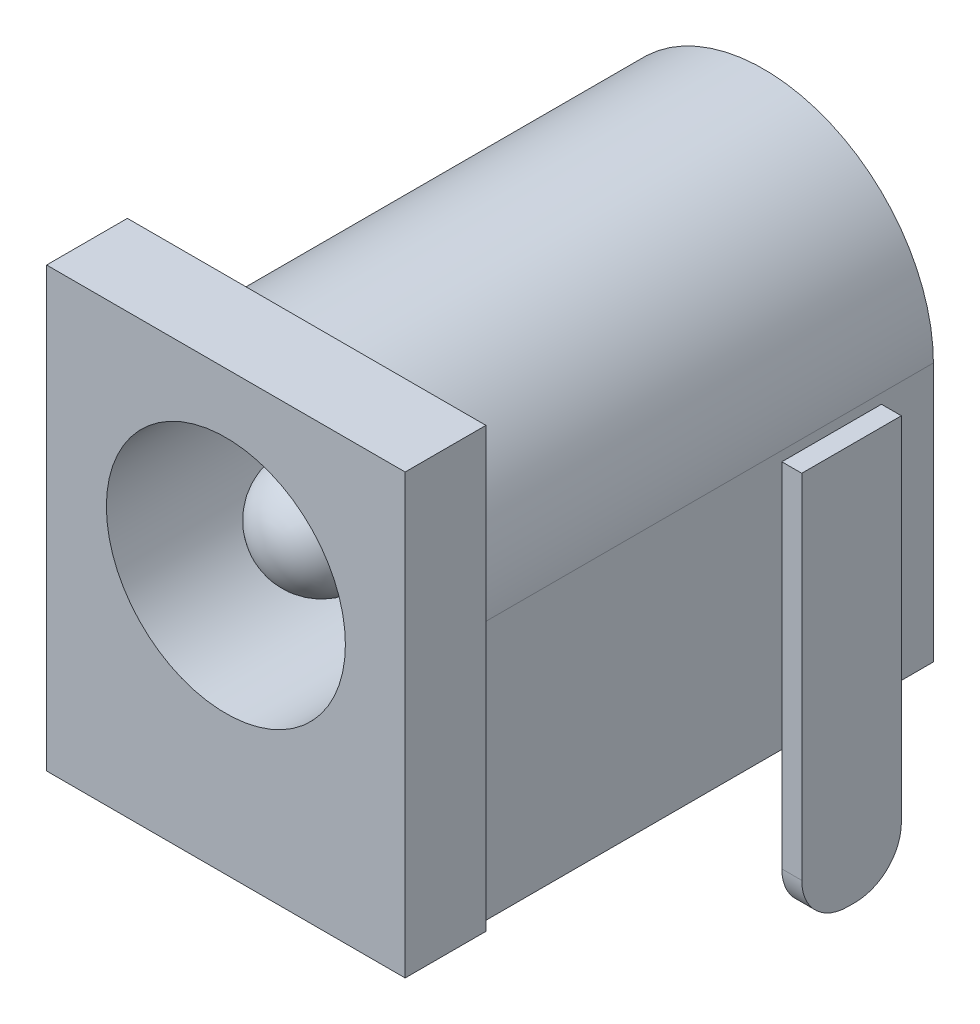
ISO-10303-21;
HEADER;
FILE_DESCRIPTION(('STEP AP214'),'2;1');
FILE_NAME('part.step','',(''),(''),'','','');
FILE_SCHEMA(('AUTOMOTIVE_DESIGN { 1 0 10303 214 1 1 1 1 }'));
ENDSEC;
DATA;
#1=APPLICATION_CONTEXT('core data for automotive mechanical design processes');
#2=APPLICATION_PROTOCOL_DEFINITION('international standard','automotive_design',2000,#1);
#3=PRODUCT_CONTEXT('',#1,'mechanical');
#4=PRODUCT('Part','Part','',(#3));
#5=PRODUCT_RELATED_PRODUCT_CATEGORY('part','',(#4));
#6=PRODUCT_DEFINITION_FORMATION('','',#4);
#7=PRODUCT_DEFINITION_CONTEXT('part definition',#1,'design');
#8=PRODUCT_DEFINITION('design','',#6,#7);
#9=PRODUCT_DEFINITION_SHAPE('','',#8);
#10=(LENGTH_UNIT() NAMED_UNIT(*) SI_UNIT(.MILLI.,.METRE.));
#11=(NAMED_UNIT(*) PLANE_ANGLE_UNIT() SI_UNIT($,.RADIAN.));
#12=(NAMED_UNIT(*) SI_UNIT($,.STERADIAN.) SOLID_ANGLE_UNIT());
#13=UNCERTAINTY_MEASURE_WITH_UNIT(LENGTH_MEASURE(1.E-05),#10,'distance_accuracy_value','');
#14=(GEOMETRIC_REPRESENTATION_CONTEXT(3) GLOBAL_UNCERTAINTY_ASSIGNED_CONTEXT((#13)) GLOBAL_UNIT_ASSIGNED_CONTEXT((#10,
#11,#12)) REPRESENTATION_CONTEXT('',''));
#15=CARTESIAN_POINT('',(0.,0.,0.));
#16=DIRECTION('',(0.,0.,1.));
#17=DIRECTION('',(1.,0.,0.));
#18=AXIS2_PLACEMENT_3D('',#15,#16,#17);
#19=CARTESIAN_POINT('',(9.00543642404111,-3.5,1.55));
#20=DIRECTION('',(0.,1.,0.));
#21=DIRECTION('',(0.,0.,1.));
#22=AXIS2_PLACEMENT_3D('',#19,#20,#21);
#23=PLANE('',#22);
#24=DIRECTION('',(1.,0.,0.));
#25=VECTOR('',#24,1.);
#26=CARTESIAN_POINT('',(-0.00100000000000794,-3.5,2.7));
#27=LINE('',#26,#25);
#28=CARTESIAN_POINT('',(9.00543642404111,-3.5,2.7));
#29=VERTEX_POINT('',#28);
#30=CARTESIAN_POINT('',(9.50543642404111,-3.5,2.7));
#31=VERTEX_POINT('',#30);
#32=EDGE_CURVE('E94',#29,#31,#27,.T.);
#33=ORIENTED_EDGE('',*,*,#32,.T.);
#34=DIRECTION('',(0.,0.,1.));
#35=VECTOR('',#34,1.);
#36=CARTESIAN_POINT('',(9.50543642404111,-3.5,4.05));
#37=LINE('',#36,#35);
#38=CARTESIAN_POINT('',(9.50543642404111,-3.5,2.9));
#39=VERTEX_POINT('',#38);
#40=EDGE_CURVE('E111',#31,#39,#37,.T.);
#41=ORIENTED_EDGE('',*,*,#40,.T.);
#42=DIRECTION('',(1.,0.,0.));
#43=VECTOR('',#42,1.);
#44=CARTESIAN_POINT('',(-0.00100000000000794,-3.5,2.9));
#45=LINE('',#44,#43);
#46=CARTESIAN_POINT('',(9.00543642404111,-3.5,2.9));
#47=VERTEX_POINT('',#46);
#48=EDGE_CURVE('E110',#47,#39,#45,.T.);
#49=ORIENTED_EDGE('',*,*,#48,.F.);
#50=DIRECTION('',(0.,0.,-1.));
#51=VECTOR('',#50,1.);
#52=CARTESIAN_POINT('',(9.00543642404111,-3.5,4.05));
#53=LINE('',#52,#51);
#54=EDGE_CURVE('E107',#47,#29,#53,.T.);
#55=ORIENTED_EDGE('',*,*,#54,.T.);
#56=EDGE_LOOP('',(#33,#41,#49,#55));
#57=FACE_BOUND('',#56,.T.);
#58=ADVANCED_FACE('F44',(#57),#23,.F.);
#59=CARTESIAN_POINT('',(9.50543642404111,-3.5,4.05));
#60=DIRECTION('',(0.,0.,-1.));
#61=DIRECTION('',(-1.,0.,0.));
#62=AXIS2_PLACEMENT_3D('',#59,#60,#61);
#63=PLANE('',#62);
#64=DIRECTION('',(1.,0.,0.));
#65=VECTOR('',#64,1.);
#66=CARTESIAN_POINT('',(-0.00100000000000395,-2.35,4.05000000000002));
#67=LINE('',#66,#65);
#68=CARTESIAN_POINT('',(9.00543642404111,-2.35,4.05));
#69=VERTEX_POINT('',#68);
#70=CARTESIAN_POINT('',(9.50543642404111,-2.35,4.05));
#71=VERTEX_POINT('',#70);
#72=EDGE_CURVE('E145',#69,#71,#67,.T.);
#73=ORIENTED_EDGE('',*,*,#72,.T.);
#74=DIRECTION('',(0.,1.,0.));
#75=VECTOR('',#74,1.);
#76=CARTESIAN_POINT('',(9.50543642404111,-3.5,4.05));
#77=LINE('',#76,#75);
#78=CARTESIAN_POINT('',(9.50543642404111,6.5,4.05));
#79=VERTEX_POINT('',#78);
#80=EDGE_CURVE('E122',#71,#79,#77,.T.);
#81=ORIENTED_EDGE('',*,*,#80,.T.);
#82=DIRECTION('',(-1.,0.,0.));
#83=VECTOR('',#82,1.);
#84=CARTESIAN_POINT('',(9.50543642404111,6.5,4.05));
#85=LINE('',#84,#83);
#86=CARTESIAN_POINT('',(9.00543642404111,6.5,4.05));
#87=VERTEX_POINT('',#86);
#88=EDGE_CURVE('E112',#79,#87,#85,.T.);
#89=ORIENTED_EDGE('',*,*,#88,.T.);
#90=DIRECTION('',(0.,1.,0.));
#91=VECTOR('',#90,1.);
#92=CARTESIAN_POINT('',(9.00543642404111,-3.5,4.05));
#93=LINE('',#92,#91);
#94=EDGE_CURVE('E114',#69,#87,#93,.T.);
#95=ORIENTED_EDGE('',*,*,#94,.F.);
#96=EDGE_LOOP('',(#73,#81,#89,#95));
#97=FACE_BOUND('',#96,.T.);
#98=ADVANCED_FACE('F153',(#97),#63,.F.);
#99=CARTESIAN_POINT('',(9.00543642404111,-3.5,4.05));
#100=DIRECTION('',(1.,0.,0.));
#101=DIRECTION('',(0.,0.,-1.));
#102=AXIS2_PLACEMENT_3D('',#99,#100,#101);
#103=PLANE('',#102);
#104=DIRECTION('',(0.,1.,0.));
#105=VECTOR('',#104,1.);
#106=CARTESIAN_POINT('',(9.00543642404111,-3.5,1.55));
#107=LINE('',#106,#105);
#108=CARTESIAN_POINT('',(9.00543642404111,-2.35,1.55));
#109=VERTEX_POINT('',#108);
#110=CARTESIAN_POINT('',(9.00543642404111,6.5,1.55));
#111=VERTEX_POINT('',#110);
#112=EDGE_CURVE('E12',#109,#111,#107,.T.);
#113=ORIENTED_EDGE('',*,*,#112,.F.);
#114=CARTESIAN_POINT('',(9.00543642404111,-2.35,2.7));
#115=DIRECTION('',(1.,0.,0.));
#116=DIRECTION('',(0.,0.,-1.));
#117=AXIS2_PLACEMENT_3D('',#114,#115,#116);
#118=CIRCLE('',#117,1.15);
#119=EDGE_CURVE('E97',#29,#109,#118,.T.);
#120=ORIENTED_EDGE('',*,*,#119,.F.);
#121=ORIENTED_EDGE('',*,*,#54,.F.);
#122=CARTESIAN_POINT('',(9.00543642404111,-2.35,2.9));
#123=DIRECTION('',(1.,0.,0.));
#124=DIRECTION('',(0.,0.,-1.));
#125=AXIS2_PLACEMENT_3D('',#122,#123,#124);
#126=CIRCLE('',#125,1.15);
#127=EDGE_CURVE('E67',#69,#47,#126,.T.);
#128=ORIENTED_EDGE('',*,*,#127,.F.);
#129=ORIENTED_EDGE('',*,*,#94,.T.);
#130=DIRECTION('',(0.,0.,-1.));
#131=VECTOR('',#130,1.);
#132=CARTESIAN_POINT('',(9.00543642404111,6.5,4.05));
#133=LINE('',#132,#131);
#134=EDGE_CURVE('E138',#87,#111,#133,.T.);
#135=ORIENTED_EDGE('',*,*,#134,.T.);
#136=EDGE_LOOP('',(#113,#120,#121,#128,#129,#135));
#137=FACE_BOUND('',#136,.T.);
#138=ADVANCED_FACE('F46',(#137),#103,.F.);
#139=CARTESIAN_POINT('',(9.50543642404111,-3.5,1.55));
#140=DIRECTION('',(0.,0.,1.));
#141=DIRECTION('',(1.,0.,0.));
#142=AXIS2_PLACEMENT_3D('',#139,#140,#141);
#143=PLANE('',#142);
#144=DIRECTION('',(0.,1.,0.));
#145=VECTOR('',#144,1.);
#146=CARTESIAN_POINT('',(9.50543642404111,-3.5,1.55));
#147=LINE('',#146,#145);
#148=CARTESIAN_POINT('',(9.50543642404111,-2.35,1.55));
#149=VERTEX_POINT('',#148);
#150=CARTESIAN_POINT('',(9.50543642404111,6.5,1.55));
#151=VERTEX_POINT('',#150);
#152=EDGE_CURVE('E52',#149,#151,#147,.T.);
#153=ORIENTED_EDGE('',*,*,#152,.F.);
#154=DIRECTION('',(1.,0.,0.));
#155=VECTOR('',#154,1.);
#156=CARTESIAN_POINT('',(-0.00100000000000894,-2.35,1.55000000000001));
#157=LINE('',#156,#155);
#158=EDGE_CURVE('E102',#109,#149,#157,.T.);
#159=ORIENTED_EDGE('',*,*,#158,.F.);
#160=ORIENTED_EDGE('',*,*,#112,.T.);
#161=DIRECTION('',(1.,0.,0.));
#162=VECTOR('',#161,1.);
#163=CARTESIAN_POINT('',(9.50543642404111,6.5,1.55));
#164=LINE('',#163,#162);
#165=EDGE_CURVE('E136',#111,#151,#164,.T.);
#166=ORIENTED_EDGE('',*,*,#165,.T.);
#167=EDGE_LOOP('',(#153,#159,#160,#166));
#168=FACE_BOUND('',#167,.T.);
#169=ADVANCED_FACE('F137',(#168),#143,.F.);
#170=CARTESIAN_POINT('',(9.50543642404111,-3.5,4.05));
#171=DIRECTION('',(-1.,0.,0.));
#172=DIRECTION('',(0.,0.,1.));
#173=AXIS2_PLACEMENT_3D('',#170,#171,#172);
#174=PLANE('',#173);
#175=ORIENTED_EDGE('',*,*,#40,.F.);
#176=CARTESIAN_POINT('',(9.50543642404111,-2.35,2.7));
#177=DIRECTION('',(-1.,0.,0.));
#178=DIRECTION('',(0.,0.,-1.));
#179=AXIS2_PLACEMENT_3D('',#176,#177,#178);
#180=CIRCLE('',#179,1.15);
#181=EDGE_CURVE('E59',#149,#31,#180,.T.);
#182=ORIENTED_EDGE('',*,*,#181,.F.);
#183=ORIENTED_EDGE('',*,*,#152,.T.);
#184=DIRECTION('',(0.,0.,1.));
#185=VECTOR('',#184,1.);
#186=CARTESIAN_POINT('',(9.50543642404111,6.5,4.05));
#187=LINE('',#186,#185);
#188=EDGE_CURVE('E117',#151,#79,#187,.T.);
#189=ORIENTED_EDGE('',*,*,#188,.T.);
#190=ORIENTED_EDGE('',*,*,#80,.F.);
#191=CARTESIAN_POINT('',(9.50543642404111,-2.35,2.9));
#192=DIRECTION('',(-1.,0.,0.));
#193=DIRECTION('',(0.,0.,-1.));
#194=AXIS2_PLACEMENT_3D('',#191,#192,#193);
#195=CIRCLE('',#194,1.15);
#196=EDGE_CURVE('E140',#39,#71,#195,.T.);
#197=ORIENTED_EDGE('',*,*,#196,.F.);
#198=EDGE_LOOP('',(#175,#182,#183,#189,#190,#197));
#199=FACE_BOUND('',#198,.T.);
#200=ADVANCED_FACE('F127',(#199),#174,.F.);
#201=CARTESIAN_POINT('',(9.00543642404111,6.5,1.55));
#202=DIRECTION('',(0.,1.,0.));
#203=DIRECTION('',(0.,0.,1.));
#204=AXIS2_PLACEMENT_3D('',#201,#202,#203);
#205=PLANE('',#204);
#206=ORIENTED_EDGE('',*,*,#134,.F.);
#207=ORIENTED_EDGE('',*,*,#88,.F.);
#208=ORIENTED_EDGE('',*,*,#188,.F.);
#209=ORIENTED_EDGE('',*,*,#165,.F.);
#210=EDGE_LOOP('',(#206,#207,#208,#209));
#211=FACE_BOUND('',#210,.T.);
#212=ADVANCED_FACE('F135',(#211),#205,.T.);
#213=CARTESIAN_POINT('',(-0.00100000000000794,-2.35,2.9));
#214=DIRECTION('',(1.,0.,0.));
#215=DIRECTION('',(0.,0.,-1.));
#216=AXIS2_PLACEMENT_3D('',#213,#214,#215);
#217=CYLINDRICAL_SURFACE('',#216,1.15);
#218=ORIENTED_EDGE('',*,*,#127,.T.);
#219=ORIENTED_EDGE('',*,*,#48,.T.);
#220=ORIENTED_EDGE('',*,*,#196,.T.);
#221=ORIENTED_EDGE('',*,*,#72,.F.);
#222=EDGE_LOOP('',(#218,#219,#220,#221));
#223=FACE_BOUND('',#222,.T.);
#224=ADVANCED_FACE('F151',(#223),#217,.T.);
#225=CARTESIAN_POINT('',(-0.00100000000000794,-2.35,2.7));
#226=DIRECTION('',(1.,0.,0.));
#227=DIRECTION('',(0.,0.,-1.));
#228=AXIS2_PLACEMENT_3D('',#225,#226,#227);
#229=CYLINDRICAL_SURFACE('',#228,1.15);
#230=ORIENTED_EDGE('',*,*,#119,.T.);
#231=ORIENTED_EDGE('',*,*,#158,.T.);
#232=ORIENTED_EDGE('',*,*,#181,.T.);
#233=ORIENTED_EDGE('',*,*,#32,.F.);
#234=EDGE_LOOP('',(#230,#231,#232,#233));
#235=FACE_BOUND('',#234,.T.);
#236=ADVANCED_FACE('F96',(#235),#229,.T.);
#237=CLOSED_SHELL('',(#58,#98,#138,#169,#200,#212,#224,#236));
#238=MANIFOLD_SOLID_BREP('B2',#237);
#239=CARTESIAN_POINT('',(4.5,6.5,3.));
#240=DIRECTION('',(0.,0.,1.));
#241=DIRECTION('',(1.,0.,0.));
#242=AXIS2_PLACEMENT_3D('',#239,#240,#241);
#243=PLANE('',#242);
#244=CARTESIAN_POINT('',(4.5,6.5,3.));
#245=DIRECTION('',(0.,0.,1.));
#246=DIRECTION('',(1.,0.,0.));
#247=AXIS2_PLACEMENT_3D('',#244,#245,#246);
#248=CIRCLE('',#247,3.);
#249=CARTESIAN_POINT('',(7.5,6.5,3.));
#250=VERTEX_POINT('',#249);
#251=EDGE_CURVE('E378',#250,#250,#248,.T.);
#252=ORIENTED_EDGE('',*,*,#251,.T.);
#253=EDGE_LOOP('',(#252));
#254=FACE_BOUND('',#253,.T.);
#255=CARTESIAN_POINT('',(4.5,6.5,3.));
#256=DIRECTION('',(0.,0.,1.));
#257=DIRECTION('',(1.,0.,0.));
#258=AXIS2_PLACEMENT_3D('',#255,#256,#257);
#259=CIRCLE('',#258,1.3411747981982);
#260=CARTESIAN_POINT('',(5.84117479819819,6.5,3.));
#261=VERTEX_POINT('',#260);
#262=EDGE_CURVE('E552',#261,#261,#259,.T.);
#263=ORIENTED_EDGE('',*,*,#262,.F.);
#264=EDGE_LOOP('',(#263));
#265=FACE_BOUND('',#264,.T.);
#266=ADVANCED_FACE('F219',(#254,#265),#243,.T.);
#267=CARTESIAN_POINT('',(5.75,-3.5,5.55));
#268=DIRECTION('',(0.,1.,0.));
#269=DIRECTION('',(0.,0.,1.));
#270=AXIS2_PLACEMENT_3D('',#267,#268,#269);
#271=PLANE('',#270);
#272=DIRECTION('',(1.,0.,0.));
#273=VECTOR('',#272,1.);
#274=CARTESIAN_POINT('',(5.75,-3.5,5.55));
#275=LINE('',#274,#273);
#276=CARTESIAN_POINT('',(4.4,-3.5,5.55));
#277=VERTEX_POINT('',#276);
#278=CARTESIAN_POINT('',(4.6,-3.5,5.55));
#279=VERTEX_POINT('',#278);
#280=EDGE_CURVE('E412',#277,#279,#275,.T.);
#281=ORIENTED_EDGE('',*,*,#280,.T.);
#282=DIRECTION('',(0.,0.,-1.));
#283=VECTOR('',#282,1.);
#284=CARTESIAN_POINT('',(4.6,-3.5,11.9209561867341));
#285=LINE('',#284,#283);
#286=CARTESIAN_POINT('',(4.6,-3.5,6.05));
#287=VERTEX_POINT('',#286);
#288=EDGE_CURVE('E541',#287,#279,#285,.T.);
#289=ORIENTED_EDGE('',*,*,#288,.F.);
#290=DIRECTION('',(-1.,0.,0.));
#291=VECTOR('',#290,1.);
#292=CARTESIAN_POINT('',(5.75,-3.5,6.05));
#293=LINE('',#292,#291);
#294=CARTESIAN_POINT('',(4.4,-3.5,6.05));
#295=VERTEX_POINT('',#294);
#296=EDGE_CURVE('E409',#287,#295,#293,.T.);
#297=ORIENTED_EDGE('',*,*,#296,.T.);
#298=DIRECTION('',(0.,0.,-1.));
#299=VECTOR('',#298,1.);
#300=CARTESIAN_POINT('',(4.4,-3.5,11.9209561867341));
#301=LINE('',#300,#299);
#302=EDGE_CURVE('E539',#295,#277,#301,.T.);
#303=ORIENTED_EDGE('',*,*,#302,.T.);
#304=EDGE_LOOP('',(#281,#289,#297,#303));
#305=FACE_BOUND('',#304,.T.);
#306=ADVANCED_FACE('F573',(#305),#271,.F.);
#307=CARTESIAN_POINT('',(5.75,-3.5,0.173550286922379));
#308=DIRECTION('',(0.,-1.,0.));
#309=DIRECTION('',(0.,0.,-1.));
#310=AXIS2_PLACEMENT_3D('',#307,#308,#309);
#311=PLANE('',#310);
#312=DIRECTION('',(1.,0.,0.));
#313=VECTOR('',#312,1.);
#314=CARTESIAN_POINT('',(5.75,-3.5,-0.326449713077622));
#315=LINE('',#314,#313);
#316=CARTESIAN_POINT('',(4.4,-3.5,-0.326449713077622));
#317=VERTEX_POINT('',#316);
#318=CARTESIAN_POINT('',(4.6,-3.5,-0.326449713077622));
#319=VERTEX_POINT('',#318);
#320=EDGE_CURVE('E395',#317,#319,#315,.T.);
#321=ORIENTED_EDGE('',*,*,#320,.T.);
#322=DIRECTION('',(0.,0.,-1.));
#323=VECTOR('',#322,1.);
#324=CARTESIAN_POINT('',(4.6,-3.5,11.9209561867341));
#325=LINE('',#324,#323);
#326=CARTESIAN_POINT('',(4.6,-3.5,0.173550286922379));
#327=VERTEX_POINT('',#326);
#328=EDGE_CURVE('E42',#319,#327,#325,.F.);
#329=ORIENTED_EDGE('',*,*,#328,.T.);
#330=DIRECTION('',(-1.,0.,0.));
#331=VECTOR('',#330,1.);
#332=CARTESIAN_POINT('',(5.75,-3.5,0.173550286922379));
#333=LINE('',#332,#331);
#334=CARTESIAN_POINT('',(4.4,-3.5,0.173550286922378));
#335=VERTEX_POINT('',#334);
#336=EDGE_CURVE('E399',#327,#335,#333,.T.);
#337=ORIENTED_EDGE('',*,*,#336,.T.);
#338=DIRECTION('',(0.,0.,-1.));
#339=VECTOR('',#338,1.);
#340=CARTESIAN_POINT('',(4.4,-3.5,11.9209561867341));
#341=LINE('',#340,#339);
#342=EDGE_CURVE('E228',#317,#335,#341,.F.);
#343=ORIENTED_EDGE('',*,*,#342,.F.);
#344=EDGE_LOOP('',(#321,#329,#337,#343));
#345=FACE_BOUND('',#344,.T.);
#346=ADVANCED_FACE('F521',(#345),#311,.T.);
#347=CARTESIAN_POINT('',(0.,0.,13.5));
#348=DIRECTION('',(0.,1.,0.));
#349=DIRECTION('',(0.,0.,1.));
#350=AXIS2_PLACEMENT_3D('',#347,#348,#349);
#351=PLANE('',#350);
#352=DIRECTION('',(0.,0.,1.));
#353=VECTOR('',#352,1.);
#354=CARTESIAN_POINT('',(5.75000000000001,0.,13.5));
#355=LINE('',#354,#353);
#356=CARTESIAN_POINT('',(5.75,0.,5.55));
#357=VERTEX_POINT('',#356);
#358=CARTESIAN_POINT('',(5.75,0.,6.05));
#359=VERTEX_POINT('',#358);
#360=EDGE_CURVE('E492',#357,#359,#355,.T.);
#361=ORIENTED_EDGE('',*,*,#360,.F.);
#362=DIRECTION('',(1.,0.,0.));
#363=VECTOR('',#362,1.);
#364=CARTESIAN_POINT('',(0.,0.,5.55));
#365=LINE('',#364,#363);
#366=CARTESIAN_POINT('',(3.25,0.,5.55));
#367=VERTEX_POINT('',#366);
#368=EDGE_CURVE('E483',#367,#357,#365,.T.);
#369=ORIENTED_EDGE('',*,*,#368,.F.);
#370=DIRECTION('',(0.,0.,-1.));
#371=VECTOR('',#370,1.);
#372=CARTESIAN_POINT('',(3.25,0.,13.5));
#373=LINE('',#372,#371);
#374=CARTESIAN_POINT('',(3.25,0.,6.05));
#375=VERTEX_POINT('',#374);
#376=EDGE_CURVE('E486',#375,#367,#373,.T.);
#377=ORIENTED_EDGE('',*,*,#376,.F.);
#378=DIRECTION('',(-1.,0.,0.));
#379=VECTOR('',#378,1.);
#380=CARTESIAN_POINT('',(0.,0.,6.05));
#381=LINE('',#380,#379);
#382=EDGE_CURVE('E489',#359,#375,#381,.T.);
#383=ORIENTED_EDGE('',*,*,#382,.F.);
#384=EDGE_LOOP('',(#361,#369,#377,#383));
#385=FACE_BOUND('',#384,.T.);
#386=DIRECTION('',(0.,0.,1.));
#387=VECTOR('',#386,1.);
#388=CARTESIAN_POINT('',(5.75000000000005,0.,13.5));
#389=LINE('',#388,#387);
#390=CARTESIAN_POINT('',(5.75,0.,0.));
#391=VERTEX_POINT('',#390);
#392=CARTESIAN_POINT('',(5.75,0.,0.173550286922379));
#393=VERTEX_POINT('',#392);
#394=EDGE_CURVE('E407',#391,#393,#389,.T.);
#395=ORIENTED_EDGE('',*,*,#394,.F.);
#396=DIRECTION('',(1.,0.,0.));
#397=VECTOR('',#396,1.);
#398=CARTESIAN_POINT('',(0.,0.,0.));
#399=LINE('',#398,#397);
#400=CARTESIAN_POINT('',(8.75986173325593,0.,0.));
#401=VERTEX_POINT('',#400);
#402=EDGE_CURVE('E456',#391,#401,#399,.T.);
#403=ORIENTED_EDGE('',*,*,#402,.T.);
#404=DIRECTION('',(0.,0.,-1.));
#405=VECTOR('',#404,1.);
#406=CARTESIAN_POINT('',(8.75986173325593,0.,11.4721847336654));
#407=LINE('',#406,#405);
#408=CARTESIAN_POINT('',(8.75986173325593,0.,11.4721847336654));
#409=VERTEX_POINT('',#408);
#410=EDGE_CURVE('E436',#409,#401,#407,.T.);
#411=ORIENTED_EDGE('',*,*,#410,.F.);
#412=DIRECTION('',(1.,0.,0.));
#413=VECTOR('',#412,1.);
#414=CARTESIAN_POINT('',(-8.20117940251179,0.,11.4721847336654));
#415=LINE('',#414,#413);
#416=CARTESIAN_POINT('',(9.,0.,11.4721847336654));
#417=VERTEX_POINT('',#416);
#418=EDGE_CURVE('E427',#409,#417,#415,.T.);
#419=ORIENTED_EDGE('',*,*,#418,.T.);
#420=DIRECTION('',(0.,0.,-1.));
#421=VECTOR('',#420,1.);
#422=CARTESIAN_POINT('',(9.,0.,13.5));
#423=LINE('',#422,#421);
#424=CARTESIAN_POINT('',(9.,0.,13.5));
#425=VERTEX_POINT('',#424);
#426=EDGE_CURVE('E475',#425,#417,#423,.T.);
#427=ORIENTED_EDGE('',*,*,#426,.F.);
#428=DIRECTION('',(1.,0.,0.));
#429=VECTOR('',#428,1.);
#430=CARTESIAN_POINT('',(0.,0.,13.5));
#431=LINE('',#430,#429);
#432=CARTESIAN_POINT('',(0.,0.,13.5));
#433=VERTEX_POINT('',#432);
#434=EDGE_CURVE('E460',#433,#425,#431,.T.);
#435=ORIENTED_EDGE('',*,*,#434,.F.);
#436=DIRECTION('',(0.,0.,-1.));
#437=VECTOR('',#436,1.);
#438=CARTESIAN_POINT('',(0.,0.,13.5));
#439=LINE('',#438,#437);
#440=CARTESIAN_POINT('',(0.,0.,11.4721847336654));
#441=VERTEX_POINT('',#440);
#442=EDGE_CURVE('E478',#433,#441,#439,.T.);
#443=ORIENTED_EDGE('',*,*,#442,.T.);
#444=CARTESIAN_POINT('',(0.240138266744069,0.,11.4721847336654));
#445=VERTEX_POINT('',#444);
#446=EDGE_CURVE('E424',#441,#445,#415,.T.);
#447=ORIENTED_EDGE('',*,*,#446,.T.);
#448=DIRECTION('',(0.,0.,-1.));
#449=VECTOR('',#448,1.);
#450=CARTESIAN_POINT('',(0.240138266744069,0.,11.4721847336654));
#451=LINE('',#450,#449);
#452=CARTESIAN_POINT('',(0.240138266744069,0.,0.));
#453=VERTEX_POINT('',#452);
#454=EDGE_CURVE('E443',#445,#453,#451,.T.);
#455=ORIENTED_EDGE('',*,*,#454,.T.);
#456=CARTESIAN_POINT('',(3.25,0.,0.));
#457=VERTEX_POINT('',#456);
#458=EDGE_CURVE('E461',#453,#457,#399,.T.);
#459=ORIENTED_EDGE('',*,*,#458,.T.);
#460=DIRECTION('',(0.,0.,-1.));
#461=VECTOR('',#460,1.);
#462=CARTESIAN_POINT('',(3.25,0.,13.5));
#463=LINE('',#462,#461);
#464=CARTESIAN_POINT('',(3.25,0.,0.173550286922379));
#465=VERTEX_POINT('',#464);
#466=EDGE_CURVE('E405',#465,#457,#463,.T.);
#467=ORIENTED_EDGE('',*,*,#466,.F.);
#468=DIRECTION('',(-1.,0.,0.));
#469=VECTOR('',#468,1.);
#470=CARTESIAN_POINT('',(0.,0.,0.173550286922378));
#471=LINE('',#470,#469);
#472=EDGE_CURVE('E504',#393,#465,#471,.T.);
#473=ORIENTED_EDGE('',*,*,#472,.F.);
#474=EDGE_LOOP('',(#395,#403,#411,#419,#427,#435,#443,#447,#455,#459,#467,#473));
#475=FACE_BOUND('',#474,.T.);
#476=ADVANCED_FACE('F593',(#385,#475),#351,.F.);
#477=CARTESIAN_POINT('',(0.,11.,0.));
#478=DIRECTION('',(0.,0.,-1.));
#479=DIRECTION('',(-1.,0.,0.));
#480=AXIS2_PLACEMENT_3D('',#477,#478,#479);
#481=PLANE('',#480);
#482=ORIENTED_EDGE('',*,*,#402,.F.);
#483=DIRECTION('',(0.,1.,0.));
#484=VECTOR('',#483,1.);
#485=CARTESIAN_POINT('',(5.75,11.,0.));
#486=LINE('',#485,#484);
#487=CARTESIAN_POINT('',(5.75,6.5,0.));
#488=VERTEX_POINT('',#487);
#489=EDGE_CURVE('E501',#391,#488,#486,.T.);
#490=ORIENTED_EDGE('',*,*,#489,.T.);
#491=DIRECTION('',(-1.,0.,0.));
#492=VECTOR('',#491,1.);
#493=CARTESIAN_POINT('',(0.,6.5,0.));
#494=LINE('',#493,#492);
#495=CARTESIAN_POINT('',(3.25,6.5,0.));
#496=VERTEX_POINT('',#495);
#497=EDGE_CURVE('E495',#488,#496,#494,.T.);
#498=ORIENTED_EDGE('',*,*,#497,.T.);
#499=DIRECTION('',(0.,-1.,0.));
#500=VECTOR('',#499,1.);
#501=CARTESIAN_POINT('',(3.25,11.,0.));
#502=LINE('',#501,#500);
#503=EDGE_CURVE('E498',#496,#457,#502,.T.);
#504=ORIENTED_EDGE('',*,*,#503,.T.);
#505=ORIENTED_EDGE('',*,*,#458,.F.);
#506=DIRECTION('',(0.,-1.,0.));
#507=VECTOR('',#506,1.);
#508=CARTESIAN_POINT('',(0.240138266744069,5.64313399778519,0.));
#509=LINE('',#508,#507);
#510=CARTESIAN_POINT('',(0.240138266744068,6.5,0.));
#511=VERTEX_POINT('',#510);
#512=EDGE_CURVE('E428',#511,#453,#509,.T.);
#513=ORIENTED_EDGE('',*,*,#512,.F.);
#514=CARTESIAN_POINT('',(4.5,6.5,0.));
#515=DIRECTION('',(0.,0.,-1.));
#516=DIRECTION('',(-1.,0.,0.));
#517=AXIS2_PLACEMENT_3D('',#514,#515,#516);
#518=CIRCLE('',#517,4.25986173325593);
#519=CARTESIAN_POINT('',(8.75986173325593,6.5,0.));
#520=VERTEX_POINT('',#519);
#521=EDGE_CURVE('E439',#511,#520,#518,.T.);
#522=ORIENTED_EDGE('',*,*,#521,.T.);
#523=DIRECTION('',(0.,-1.,0.));
#524=VECTOR('',#523,1.);
#525=CARTESIAN_POINT('',(8.75986173325593,5.64313399778519,0.));
#526=LINE('',#525,#524);
#527=EDGE_CURVE('E423',#520,#401,#526,.T.);
#528=ORIENTED_EDGE('',*,*,#527,.T.);
#529=EDGE_LOOP('',(#482,#490,#498,#504,#505,#513,#522,#528));
#530=FACE_BOUND('',#529,.T.);
#531=ADVANCED_FACE('F641',(#530),#481,.T.);
#532=CARTESIAN_POINT('',(0.,0.,13.5));
#533=DIRECTION('',(1.,0.,0.));
#534=DIRECTION('',(0.,1.,0.));
#535=AXIS2_PLACEMENT_3D('',#532,#533,#534);
#536=PLANE('',#535);
#537=DIRECTION('',(0.,1.,0.));
#538=VECTOR('',#537,1.);
#539=CARTESIAN_POINT('',(0.,0.,11.4721847336654));
#540=LINE('',#539,#538);
#541=CARTESIAN_POINT('',(0.,11.,11.4721847336654));
#542=VERTEX_POINT('',#541);
#543=EDGE_CURVE('E454',#441,#542,#540,.T.);
#544=ORIENTED_EDGE('',*,*,#543,.F.);
#545=ORIENTED_EDGE('',*,*,#442,.F.);
#546=DIRECTION('',(0.,-1.,0.));
#547=VECTOR('',#546,1.);
#548=CARTESIAN_POINT('',(0.,0.,13.5));
#549=LINE('',#548,#547);
#550=CARTESIAN_POINT('',(0.,11.,13.5));
#551=VERTEX_POINT('',#550);
#552=EDGE_CURVE('E457',#551,#433,#549,.T.);
#553=ORIENTED_EDGE('',*,*,#552,.F.);
#554=DIRECTION('',(0.,0.,-1.));
#555=VECTOR('',#554,1.);
#556=CARTESIAN_POINT('',(0.,11.,13.5));
#557=LINE('',#556,#555);
#558=EDGE_CURVE('E467',#551,#542,#557,.T.);
#559=ORIENTED_EDGE('',*,*,#558,.T.);
#560=EDGE_LOOP('',(#544,#545,#553,#559));
#561=FACE_BOUND('',#560,.T.);
#562=ADVANCED_FACE('F644',(#561),#536,.F.);
#563=CARTESIAN_POINT('',(9.,0.,13.5));
#564=DIRECTION('',(-1.,0.,0.));
#565=DIRECTION('',(0.,-1.,0.));
#566=AXIS2_PLACEMENT_3D('',#563,#564,#565);
#567=PLANE('',#566);
#568=DIRECTION('',(0.,-1.,0.));
#569=VECTOR('',#568,1.);
#570=CARTESIAN_POINT('',(9.,0.,11.4721847336654));
#571=LINE('',#570,#569);
#572=CARTESIAN_POINT('',(9.,11.,11.4721847336654));
#573=VERTEX_POINT('',#572);
#574=EDGE_CURVE('E446',#573,#417,#571,.T.);
#575=ORIENTED_EDGE('',*,*,#574,.F.);
#576=DIRECTION('',(0.,0.,-1.));
#577=VECTOR('',#576,1.);
#578=CARTESIAN_POINT('',(9.,11.,13.5));
#579=LINE('',#578,#577);
#580=CARTESIAN_POINT('',(9.,11.,13.5));
#581=VERTEX_POINT('',#580);
#582=EDGE_CURVE('E472',#581,#573,#579,.T.);
#583=ORIENTED_EDGE('',*,*,#582,.F.);
#584=DIRECTION('',(0.,1.,0.));
#585=VECTOR('',#584,1.);
#586=CARTESIAN_POINT('',(9.,0.,13.5));
#587=LINE('',#586,#585);
#588=EDGE_CURVE('E463',#425,#581,#587,.T.);
#589=ORIENTED_EDGE('',*,*,#588,.F.);
#590=ORIENTED_EDGE('',*,*,#426,.T.);
#591=EDGE_LOOP('',(#575,#583,#589,#590));
#592=FACE_BOUND('',#591,.T.);
#593=ADVANCED_FACE('F648',(#592),#567,.F.);
#594=CARTESIAN_POINT('',(0.,11.,13.5));
#595=DIRECTION('',(0.,-1.,0.));
#596=DIRECTION('',(0.,0.,-1.));
#597=AXIS2_PLACEMENT_3D('',#594,#595,#596);
#598=PLANE('',#597);
#599=DIRECTION('',(1.,0.,0.));
#600=VECTOR('',#599,1.);
#601=CARTESIAN_POINT('',(0.,11.,11.4721847336654));
#602=LINE('',#601,#600);
#603=EDGE_CURVE('E481',#542,#573,#602,.T.);
#604=ORIENTED_EDGE('',*,*,#603,.F.);
#605=ORIENTED_EDGE('',*,*,#558,.F.);
#606=DIRECTION('',(-1.,0.,0.));
#607=VECTOR('',#606,1.);
#608=CARTESIAN_POINT('',(0.,11.,13.5));
#609=LINE('',#608,#607);
#610=EDGE_CURVE('E465',#581,#551,#609,.T.);
#611=ORIENTED_EDGE('',*,*,#610,.F.);
#612=ORIENTED_EDGE('',*,*,#582,.T.);
#613=EDGE_LOOP('',(#604,#605,#611,#612));
#614=FACE_BOUND('',#613,.T.);
#615=ADVANCED_FACE('F639',(#614),#598,.F.);
#616=CARTESIAN_POINT('',(0.,11.,13.5));
#617=DIRECTION('',(0.,0.,-1.));
#618=DIRECTION('',(-1.,0.,0.));
#619=AXIS2_PLACEMENT_3D('',#616,#617,#618);
#620=PLANE('',#619);
#621=CARTESIAN_POINT('',(4.5,6.5,13.5));
#622=DIRECTION('',(0.,0.,1.));
#623=DIRECTION('',(1.,0.,0.));
#624=AXIS2_PLACEMENT_3D('',#621,#622,#623);
#625=CIRCLE('',#624,3.);
#626=CARTESIAN_POINT('',(7.5,6.5,13.5));
#627=VERTEX_POINT('',#626);
#628=EDGE_CURVE('E547',#627,#627,#625,.T.);
#629=ORIENTED_EDGE('',*,*,#628,.F.);
#630=EDGE_LOOP('',(#629));
#631=FACE_BOUND('',#630,.T.);
#632=ORIENTED_EDGE('',*,*,#552,.T.);
#633=ORIENTED_EDGE('',*,*,#434,.T.);
#634=ORIENTED_EDGE('',*,*,#588,.T.);
#635=ORIENTED_EDGE('',*,*,#610,.T.);
#636=EDGE_LOOP('',(#632,#633,#634,#635));
#637=FACE_BOUND('',#636,.T.);
#638=ADVANCED_FACE('F625',(#631,#637),#620,.F.);
#639=CARTESIAN_POINT('',(-8.20117940251179,5.64313399778519,11.4721847336654));
#640=DIRECTION('',(0.,0.,-1.));
#641=DIRECTION('',(-1.,0.,0.));
#642=AXIS2_PLACEMENT_3D('',#639,#640,#641);
#643=PLANE('',#642);
#644=ORIENTED_EDGE('',*,*,#543,.T.);
#645=ORIENTED_EDGE('',*,*,#603,.T.);
#646=ORIENTED_EDGE('',*,*,#574,.T.);
#647=ORIENTED_EDGE('',*,*,#418,.F.);
#648=DIRECTION('',(0.,-1.,0.));
#649=VECTOR('',#648,1.);
#650=CARTESIAN_POINT('',(8.75986173325593,5.64313399778519,11.4721847336654));
#651=LINE('',#650,#649);
#652=CARTESIAN_POINT('',(8.75986173325593,6.5,11.4721847336654));
#653=VERTEX_POINT('',#652);
#654=EDGE_CURVE('E429',#653,#409,#651,.T.);
#655=ORIENTED_EDGE('',*,*,#654,.F.);
#656=CARTESIAN_POINT('',(4.5,6.5,11.4721847336654));
#657=DIRECTION('',(0.,0.,-1.));
#658=DIRECTION('',(-1.,0.,0.));
#659=AXIS2_PLACEMENT_3D('',#656,#657,#658);
#660=CIRCLE('',#659,4.25986173325593);
#661=CARTESIAN_POINT('',(0.240138266744068,6.5,11.4721847336654));
#662=VERTEX_POINT('',#661);
#663=EDGE_CURVE('E431',#662,#653,#660,.T.);
#664=ORIENTED_EDGE('',*,*,#663,.F.);
#665=DIRECTION('',(0.,-1.,0.));
#666=VECTOR('',#665,1.);
#667=CARTESIAN_POINT('',(0.240138266744069,5.64313399778519,11.4721847336654));
#668=LINE('',#667,#666);
#669=EDGE_CURVE('E433',#662,#445,#668,.T.);
#670=ORIENTED_EDGE('',*,*,#669,.T.);
#671=ORIENTED_EDGE('',*,*,#446,.F.);
#672=EDGE_LOOP('',(#644,#645,#646,#647,#655,#664,#670,#671));
#673=FACE_BOUND('',#672,.T.);
#674=ADVANCED_FACE('F621',(#673),#643,.T.);
#675=CARTESIAN_POINT('',(0.240138266744069,5.64313399778519,11.4721847336654));
#676=DIRECTION('',(1.,0.,0.));
#677=DIRECTION('',(0.,1.,0.));
#678=AXIS2_PLACEMENT_3D('',#675,#676,#677);
#679=PLANE('',#678);
#680=ORIENTED_EDGE('',*,*,#512,.T.);
#681=ORIENTED_EDGE('',*,*,#454,.F.);
#682=ORIENTED_EDGE('',*,*,#669,.F.);
#683=DIRECTION('',(0.,0.,-1.));
#684=VECTOR('',#683,1.);
#685=CARTESIAN_POINT('',(0.240138266744068,6.5,11.4721847336654));
#686=LINE('',#685,#684);
#687=EDGE_CURVE('E447',#662,#511,#686,.T.);
#688=ORIENTED_EDGE('',*,*,#687,.T.);
#689=EDGE_LOOP('',(#680,#681,#682,#688));
#690=FACE_BOUND('',#689,.T.);
#691=ADVANCED_FACE('F624',(#690),#679,.F.);
#692=CARTESIAN_POINT('',(4.5,6.5,11.4721847336654));
#693=DIRECTION('',(0.,0.,-1.));
#694=DIRECTION('',(-1.,0.,0.));
#695=AXIS2_PLACEMENT_3D('',#692,#693,#694);
#696=CYLINDRICAL_SURFACE('',#695,4.25986173325593);
#697=ORIENTED_EDGE('',*,*,#521,.F.);
#698=ORIENTED_EDGE('',*,*,#687,.F.);
#699=ORIENTED_EDGE('',*,*,#663,.T.);
#700=DIRECTION('',(0.,0.,-1.));
#701=VECTOR('',#700,1.);
#702=CARTESIAN_POINT('',(8.75986173325593,6.5,11.4721847336654));
#703=LINE('',#702,#701);
#704=EDGE_CURVE('E449',#653,#520,#703,.T.);
#705=ORIENTED_EDGE('',*,*,#704,.T.);
#706=EDGE_LOOP('',(#697,#698,#699,#705));
#707=FACE_BOUND('',#706,.T.);
#708=ADVANCED_FACE('F629',(#707),#696,.T.);
#709=CARTESIAN_POINT('',(8.75986173325593,5.64313399778519,11.4721847336654));
#710=DIRECTION('',(1.,0.,0.));
#711=DIRECTION('',(0.,0.,-1.));
#712=AXIS2_PLACEMENT_3D('',#709,#710,#711);
#713=PLANE('',#712);
#714=ORIENTED_EDGE('',*,*,#527,.F.);
#715=ORIENTED_EDGE('',*,*,#704,.F.);
#716=ORIENTED_EDGE('',*,*,#654,.T.);
#717=ORIENTED_EDGE('',*,*,#410,.T.);
#718=EDGE_LOOP('',(#714,#715,#716,#717));
#719=FACE_BOUND('',#718,.T.);
#720=ADVANCED_FACE('F619',(#719),#713,.T.);
#721=CARTESIAN_POINT('',(5.75,-3.5,6.05));
#722=DIRECTION('',(-1.,0.,0.));
#723=DIRECTION('',(0.,0.,1.));
#724=AXIS2_PLACEMENT_3D('',#721,#722,#723);
#725=PLANE('',#724);
#726=ORIENTED_EDGE('',*,*,#360,.T.);
#727=DIRECTION('',(0.,1.,0.));
#728=VECTOR('',#727,1.);
#729=CARTESIAN_POINT('',(5.75,-3.5,6.05));
#730=LINE('',#729,#728);
#731=CARTESIAN_POINT('',(5.75,-2.35,6.05));
#732=VERTEX_POINT('',#731);
#733=EDGE_CURVE('E421',#732,#359,#730,.T.);
#734=ORIENTED_EDGE('',*,*,#733,.F.);
#735=DIRECTION('',(0.,0.,-1.));
#736=VECTOR('',#735,1.);
#737=CARTESIAN_POINT('',(5.75,-2.35,11.9209561867341));
#738=LINE('',#737,#736);
#739=CARTESIAN_POINT('',(5.75,-2.35,5.55));
#740=VERTEX_POINT('',#739);
#741=EDGE_CURVE('E388',#732,#740,#738,.T.);
#742=ORIENTED_EDGE('',*,*,#741,.T.);
#743=DIRECTION('',(0.,1.,0.));
#744=VECTOR('',#743,1.);
#745=CARTESIAN_POINT('',(5.75,-3.5,5.55));
#746=LINE('',#745,#744);
#747=EDGE_CURVE('E415',#740,#357,#746,.T.);
#748=ORIENTED_EDGE('',*,*,#747,.T.);
#749=EDGE_LOOP('',(#726,#734,#742,#748));
#750=FACE_BOUND('',#749,.T.);
#751=ADVANCED_FACE('F615',(#750),#725,.F.);
#752=CARTESIAN_POINT('',(5.75,-3.5,6.05));
#753=DIRECTION('',(0.,0.,-1.));
#754=DIRECTION('',(-1.,0.,0.));
#755=AXIS2_PLACEMENT_3D('',#752,#753,#754);
#756=PLANE('',#755);
#757=ORIENTED_EDGE('',*,*,#296,.F.);
#758=CARTESIAN_POINT('',(4.6,-2.35,6.05));
#759=DIRECTION('',(0.,0.,-1.));
#760=DIRECTION('',(-1.,0.,0.));
#761=AXIS2_PLACEMENT_3D('',#758,#759,#760);
#762=CIRCLE('',#761,1.15);
#763=EDGE_CURVE('E243',#732,#287,#762,.T.);
#764=ORIENTED_EDGE('',*,*,#763,.F.);
#765=ORIENTED_EDGE('',*,*,#733,.T.);
#766=ORIENTED_EDGE('',*,*,#382,.T.);
#767=DIRECTION('',(0.,1.,0.));
#768=VECTOR('',#767,1.);
#769=CARTESIAN_POINT('',(3.25,-3.5,6.05));
#770=LINE('',#769,#768);
#771=CARTESIAN_POINT('',(3.25,-2.35,6.05));
#772=VERTEX_POINT('',#771);
#773=EDGE_CURVE('E419',#772,#375,#770,.T.);
#774=ORIENTED_EDGE('',*,*,#773,.F.);
#775=CARTESIAN_POINT('',(4.4,-2.35,6.05));
#776=DIRECTION('',(0.,0.,-1.));
#777=DIRECTION('',(-1.,0.,0.));
#778=AXIS2_PLACEMENT_3D('',#775,#776,#777);
#779=CIRCLE('',#778,1.15);
#780=EDGE_CURVE('E543',#295,#772,#779,.T.);
#781=ORIENTED_EDGE('',*,*,#780,.F.);
#782=EDGE_LOOP('',(#757,#764,#765,#766,#774,#781));
#783=FACE_BOUND('',#782,.T.);
#784=ADVANCED_FACE('F611',(#783),#756,.F.);
#785=CARTESIAN_POINT('',(3.25,-3.5,6.05));
#786=DIRECTION('',(1.,0.,0.));
#787=DIRECTION('',(0.,0.,-1.));
#788=AXIS2_PLACEMENT_3D('',#785,#786,#787);
#789=PLANE('',#788);
#790=ORIENTED_EDGE('',*,*,#376,.T.);
#791=DIRECTION('',(0.,1.,0.));
#792=VECTOR('',#791,1.);
#793=CARTESIAN_POINT('',(3.25,-3.5,5.55));
#794=LINE('',#793,#792);
#795=CARTESIAN_POINT('',(3.25,-2.35,5.55));
#796=VERTEX_POINT('',#795);
#797=EDGE_CURVE('E417',#796,#367,#794,.T.);
#798=ORIENTED_EDGE('',*,*,#797,.F.);
#799=DIRECTION('',(0.,0.,-1.));
#800=VECTOR('',#799,1.);
#801=CARTESIAN_POINT('',(3.25,-2.35,11.9209561867341));
#802=LINE('',#801,#800);
#803=EDGE_CURVE('E537',#772,#796,#802,.T.);
#804=ORIENTED_EDGE('',*,*,#803,.F.);
#805=ORIENTED_EDGE('',*,*,#773,.T.);
#806=EDGE_LOOP('',(#790,#798,#804,#805));
#807=FACE_BOUND('',#806,.T.);
#808=ADVANCED_FACE('F607',(#807),#789,.F.);
#809=CARTESIAN_POINT('',(5.75,-3.5,5.55));
#810=DIRECTION('',(0.,0.,1.));
#811=DIRECTION('',(1.,0.,0.));
#812=AXIS2_PLACEMENT_3D('',#809,#810,#811);
#813=PLANE('',#812);
#814=ORIENTED_EDGE('',*,*,#747,.F.);
#815=CARTESIAN_POINT('',(4.6,-2.35,5.55));
#816=DIRECTION('',(0.,0.,1.));
#817=DIRECTION('',(1.,0.,0.));
#818=AXIS2_PLACEMENT_3D('',#815,#816,#817);
#819=CIRCLE('',#818,1.15);
#820=EDGE_CURVE('E529',#740,#279,#819,.F.);
#821=ORIENTED_EDGE('',*,*,#820,.T.);
#822=ORIENTED_EDGE('',*,*,#280,.F.);
#823=CARTESIAN_POINT('',(4.4,-2.35,5.55));
#824=DIRECTION('',(0.,0.,1.));
#825=DIRECTION('',(1.,0.,0.));
#826=AXIS2_PLACEMENT_3D('',#823,#824,#825);
#827=CIRCLE('',#826,1.15);
#828=EDGE_CURVE('E235',#277,#796,#827,.F.);
#829=ORIENTED_EDGE('',*,*,#828,.T.);
#830=ORIENTED_EDGE('',*,*,#797,.T.);
#831=ORIENTED_EDGE('',*,*,#368,.T.);
#832=EDGE_LOOP('',(#814,#821,#822,#829,#830,#831));
#833=FACE_BOUND('',#832,.T.);
#834=ADVANCED_FACE('F602',(#833),#813,.F.);
#835=CARTESIAN_POINT('',(5.75,-3.5,0.173550286922379));
#836=DIRECTION('',(0.,0.,-1.));
#837=DIRECTION('',(-1.,0.,0.));
#838=AXIS2_PLACEMENT_3D('',#835,#836,#837);
#839=PLANE('',#838);
#840=ORIENTED_EDGE('',*,*,#336,.F.);
#841=CARTESIAN_POINT('',(4.6,-2.35,0.173550286922378));
#842=DIRECTION('',(0.,0.,-1.));
#843=DIRECTION('',(-1.,0.,0.));
#844=AXIS2_PLACEMENT_3D('',#841,#842,#843);
#845=CIRCLE('',#844,1.15);
#846=CARTESIAN_POINT('',(5.75,-2.35,0.173550286922378));
#847=VERTEX_POINT('',#846);
#848=EDGE_CURVE('E532',#327,#847,#845,.F.);
#849=ORIENTED_EDGE('',*,*,#848,.T.);
#850=DIRECTION('',(0.,1.,0.));
#851=VECTOR('',#850,1.);
#852=CARTESIAN_POINT('',(5.75,-3.5,0.173550286922379));
#853=LINE('',#852,#851);
#854=EDGE_CURVE('E387',#847,#393,#853,.T.);
#855=ORIENTED_EDGE('',*,*,#854,.T.);
#856=ORIENTED_EDGE('',*,*,#472,.T.);
#857=DIRECTION('',(0.,1.,0.));
#858=VECTOR('',#857,1.);
#859=CARTESIAN_POINT('',(3.25,-3.5,0.173550286922379));
#860=LINE('',#859,#858);
#861=CARTESIAN_POINT('',(3.25,-2.35,0.173550286922378));
#862=VERTEX_POINT('',#861);
#863=EDGE_CURVE('E397',#862,#465,#860,.T.);
#864=ORIENTED_EDGE('',*,*,#863,.F.);
#865=CARTESIAN_POINT('',(4.4,-2.35,0.173550286922378));
#866=DIRECTION('',(0.,0.,-1.));
#867=DIRECTION('',(-1.,0.,0.));
#868=AXIS2_PLACEMENT_3D('',#865,#866,#867);
#869=CIRCLE('',#868,1.15);
#870=EDGE_CURVE('E511',#862,#335,#869,.F.);
#871=ORIENTED_EDGE('',*,*,#870,.T.);
#872=EDGE_LOOP('',(#840,#849,#855,#856,#864,#871));
#873=FACE_BOUND('',#872,.T.);
#874=ADVANCED_FACE('F519',(#873),#839,.F.);
#875=CARTESIAN_POINT('',(5.75,-3.5,-0.326449713077622));
#876=DIRECTION('',(-1.,0.,0.));
#877=DIRECTION('',(0.,0.,1.));
#878=AXIS2_PLACEMENT_3D('',#875,#876,#877);
#879=PLANE('',#878);
#880=ORIENTED_EDGE('',*,*,#394,.T.);
#881=ORIENTED_EDGE('',*,*,#854,.F.);
#882=CARTESIAN_POINT('',(5.75,-2.35,-0.326449713077622));
#883=VERTEX_POINT('',#882);
#884=EDGE_CURVE('E371',#847,#883,#738,.T.);
#885=ORIENTED_EDGE('',*,*,#884,.T.);
#886=DIRECTION('',(0.,1.,0.));
#887=VECTOR('',#886,1.);
#888=CARTESIAN_POINT('',(5.75,-3.5,-0.326449713077622));
#889=LINE('',#888,#887);
#890=CARTESIAN_POINT('',(5.75,6.5,-0.326449713077622));
#891=VERTEX_POINT('',#890);
#892=EDGE_CURVE('E385',#883,#891,#889,.T.);
#893=ORIENTED_EDGE('',*,*,#892,.T.);
#894=DIRECTION('',(0.,0.,1.));
#895=VECTOR('',#894,1.);
#896=CARTESIAN_POINT('',(5.75,6.5,-0.326449713077622));
#897=LINE('',#896,#895);
#898=EDGE_CURVE('E527',#891,#488,#897,.T.);
#899=ORIENTED_EDGE('',*,*,#898,.T.);
#900=ORIENTED_EDGE('',*,*,#489,.F.);
#901=EDGE_LOOP('',(#880,#881,#885,#893,#899,#900));
#902=FACE_BOUND('',#901,.T.);
#903=ADVANCED_FACE('F383',(#902),#879,.F.);
#904=CARTESIAN_POINT('',(3.25,-3.5,-0.326449713077622));
#905=DIRECTION('',(1.,0.,0.));
#906=DIRECTION('',(0.,0.,-1.));
#907=AXIS2_PLACEMENT_3D('',#904,#905,#906);
#908=PLANE('',#907);
#909=DIRECTION('',(0.,0.,-1.));
#910=VECTOR('',#909,1.);
#911=CARTESIAN_POINT('',(3.25,6.5,-0.326449713077622));
#912=LINE('',#911,#910);
#913=CARTESIAN_POINT('',(3.25,6.5,-0.326449713077622));
#914=VERTEX_POINT('',#913);
#915=EDGE_CURVE('E522',#496,#914,#912,.T.);
#916=ORIENTED_EDGE('',*,*,#915,.T.);
#917=DIRECTION('',(0.,1.,0.));
#918=VECTOR('',#917,1.);
#919=CARTESIAN_POINT('',(3.25,-3.5,-0.326449713077622));
#920=LINE('',#919,#918);
#921=CARTESIAN_POINT('',(3.25,-2.35,-0.326449713077622));
#922=VERTEX_POINT('',#921);
#923=EDGE_CURVE('E394',#922,#914,#920,.T.);
#924=ORIENTED_EDGE('',*,*,#923,.F.);
#925=EDGE_CURVE('E536',#862,#922,#802,.T.);
#926=ORIENTED_EDGE('',*,*,#925,.F.);
#927=ORIENTED_EDGE('',*,*,#863,.T.);
#928=ORIENTED_EDGE('',*,*,#466,.T.);
#929=ORIENTED_EDGE('',*,*,#503,.F.);
#930=EDGE_LOOP('',(#916,#924,#926,#927,#928,#929));
#931=FACE_BOUND('',#930,.T.);
#932=ADVANCED_FACE('F596',(#931),#908,.F.);
#933=CARTESIAN_POINT('',(5.75,-3.5,-0.326449713077622));
#934=DIRECTION('',(0.,0.,1.));
#935=DIRECTION('',(1.,0.,0.));
#936=AXIS2_PLACEMENT_3D('',#933,#934,#935);
#937=PLANE('',#936);
#938=ORIENTED_EDGE('',*,*,#892,.F.);
#939=CARTESIAN_POINT('',(4.6,-2.35,-0.326449713077622));
#940=DIRECTION('',(0.,0.,1.));
#941=DIRECTION('',(-1.,0.,0.));
#942=AXIS2_PLACEMENT_3D('',#939,#940,#941);
#943=CIRCLE('',#942,1.15);
#944=EDGE_CURVE('E368',#319,#883,#943,.T.);
#945=ORIENTED_EDGE('',*,*,#944,.F.);
#946=ORIENTED_EDGE('',*,*,#320,.F.);
#947=CARTESIAN_POINT('',(4.4,-2.35,-0.326449713077622));
#948=DIRECTION('',(0.,0.,1.));
#949=DIRECTION('',(-1.,0.,0.));
#950=AXIS2_PLACEMENT_3D('',#947,#948,#949);
#951=CIRCLE('',#950,1.15);
#952=EDGE_CURVE('E377',#922,#317,#951,.T.);
#953=ORIENTED_EDGE('',*,*,#952,.F.);
#954=ORIENTED_EDGE('',*,*,#923,.T.);
#955=DIRECTION('',(1.,0.,0.));
#956=VECTOR('',#955,1.);
#957=CARTESIAN_POINT('',(5.75,6.5,-0.326449713077622));
#958=LINE('',#957,#956);
#959=EDGE_CURVE('E393',#914,#891,#958,.T.);
#960=ORIENTED_EDGE('',*,*,#959,.T.);
#961=EDGE_LOOP('',(#938,#945,#946,#953,#954,#960));
#962=FACE_BOUND('',#961,.T.);
#963=ADVANCED_FACE('F391',(#962),#937,.F.);
#964=CARTESIAN_POINT('',(5.75,6.5,0.173550286922379));
#965=DIRECTION('',(0.,-1.,0.));
#966=DIRECTION('',(0.,0.,-1.));
#967=AXIS2_PLACEMENT_3D('',#964,#965,#966);
#968=PLANE('',#967);
#969=ORIENTED_EDGE('',*,*,#497,.F.);
#970=ORIENTED_EDGE('',*,*,#898,.F.);
#971=ORIENTED_EDGE('',*,*,#959,.F.);
#972=ORIENTED_EDGE('',*,*,#915,.F.);
#973=EDGE_LOOP('',(#969,#970,#971,#972));
#974=FACE_BOUND('',#973,.T.);
#975=ADVANCED_FACE('F587',(#974),#968,.F.);
#976=CARTESIAN_POINT('',(4.4,-2.35,11.9209561867341));
#977=DIRECTION('',(0.,0.,-1.));
#978=DIRECTION('',(-1.,0.,0.));
#979=AXIS2_PLACEMENT_3D('',#976,#977,#978);
#980=CYLINDRICAL_SURFACE('',#979,1.15);
#981=ORIENTED_EDGE('',*,*,#925,.T.);
#982=ORIENTED_EDGE('',*,*,#952,.T.);
#983=ORIENTED_EDGE('',*,*,#342,.T.);
#984=ORIENTED_EDGE('',*,*,#870,.F.);
#985=EDGE_LOOP('',(#981,#982,#983,#984));
#986=FACE_BOUND('',#985,.T.);
#987=ADVANCED_FACE('F510',(#986),#980,.T.);
#988=CARTESIAN_POINT('',(4.6,-2.35,11.9209561867341));
#989=DIRECTION('',(0.,0.,-1.));
#990=DIRECTION('',(-1.,0.,0.));
#991=AXIS2_PLACEMENT_3D('',#988,#989,#990);
#992=CYLINDRICAL_SURFACE('',#991,1.15);
#993=ORIENTED_EDGE('',*,*,#328,.F.);
#994=ORIENTED_EDGE('',*,*,#944,.T.);
#995=ORIENTED_EDGE('',*,*,#884,.F.);
#996=ORIENTED_EDGE('',*,*,#848,.F.);
#997=EDGE_LOOP('',(#993,#994,#995,#996));
#998=FACE_BOUND('',#997,.T.);
#999=ADVANCED_FACE('F370',(#998),#992,.T.);
#1000=ORIENTED_EDGE('',*,*,#302,.F.);
#1001=ORIENTED_EDGE('',*,*,#780,.T.);
#1002=ORIENTED_EDGE('',*,*,#803,.T.);
#1003=ORIENTED_EDGE('',*,*,#828,.F.);
#1004=EDGE_LOOP('',(#1000,#1001,#1002,#1003));
#1005=FACE_BOUND('',#1004,.T.);
#1006=ADVANCED_FACE('F582',(#1005),#980,.T.);
#1007=ORIENTED_EDGE('',*,*,#741,.F.);
#1008=ORIENTED_EDGE('',*,*,#763,.T.);
#1009=ORIENTED_EDGE('',*,*,#288,.T.);
#1010=ORIENTED_EDGE('',*,*,#820,.F.);
#1011=EDGE_LOOP('',(#1007,#1008,#1009,#1010));
#1012=FACE_BOUND('',#1011,.T.);
#1013=ADVANCED_FACE('F568',(#1012),#992,.T.);
#1014=CARTESIAN_POINT('',(4.5,6.5,3.));
#1015=DIRECTION('',(0.,0.,1.));
#1016=DIRECTION('',(1.,0.,0.));
#1017=AXIS2_PLACEMENT_3D('',#1014,#1015,#1016);
#1018=CYLINDRICAL_SURFACE('',#1017,3.);
#1019=ORIENTED_EDGE('',*,*,#251,.F.);
#1020=EDGE_LOOP('',(#1019));
#1021=FACE_BOUND('',#1020,.T.);
#1022=ORIENTED_EDGE('',*,*,#628,.T.);
#1023=EDGE_LOOP('',(#1022));
#1024=FACE_BOUND('',#1023,.T.);
#1025=ADVANCED_FACE('F562',(#1021,#1024),#1018,.F.);
#1026=CARTESIAN_POINT('',(4.5,6.5,11.5));
#1027=DIRECTION('',(0.,0.,-1.));
#1028=DIRECTION('',(-1.,0.,0.));
#1029=AXIS2_PLACEMENT_3D('',#1026,#1027,#1028);
#1030=CYLINDRICAL_SURFACE('',#1029,1.3411747981982);
#1031=CARTESIAN_POINT('',(4.5,6.5,11.5));
#1032=DIRECTION('',(0.,0.,1.));
#1033=DIRECTION('',(1.,0.,0.));
#1034=AXIS2_PLACEMENT_3D('',#1031,#1032,#1033);
#1035=CIRCLE('',#1034,1.3411747981982);
#1036=CARTESIAN_POINT('',(5.84117479819819,6.5,11.5));
#1037=VERTEX_POINT('',#1036);
#1038=EDGE_CURVE('E223',#1037,#1037,#1035,.T.);
#1039=ORIENTED_EDGE('',*,*,#1038,.F.);
#1040=EDGE_LOOP('',(#1039));
#1041=FACE_BOUND('',#1040,.T.);
#1042=ORIENTED_EDGE('',*,*,#262,.T.);
#1043=EDGE_LOOP('',(#1042));
#1044=FACE_BOUND('',#1043,.T.);
#1045=ADVANCED_FACE('F560',(#1041,#1044),#1030,.T.);
#1046=CARTESIAN_POINT('',(4.5,6.5,11.100625080339));
#1047=DIRECTION('',(0.,0.,1.));
#1048=DIRECTION('',(1.,0.,0.));
#1049=AXIS2_PLACEMENT_3D('',#1046,#1047,#1048);
#1050=SPHERICAL_SURFACE('',#1049,1.39937491966099);
#1051=ORIENTED_EDGE('',*,*,#1038,.T.);
#1052=EDGE_LOOP('',(#1051));
#1053=FACE_BOUND('',#1052,.T.);
#1054=ADVANCED_FACE('F221',(#1053),#1050,.T.);
#1055=CLOSED_SHELL('',(#266,#306,#346,#476,#531,#562,#593,#615,#638,#674,#691,#708,#720,#751,
#784,#808,#834,#874,#903,#932,#963,#975,#987,#999,#1006,#1013,#1025,#1045,#1054));
#1056=MANIFOLD_SOLID_BREP('B6',#1055);
#1057=ADVANCED_BREP_SHAPE_REPRESENTATION('',(#18,#238,#1056),#14);
#1058=SHAPE_DEFINITION_REPRESENTATION(#9,#1057);
ENDSEC;
END-ISO-10303-21;
